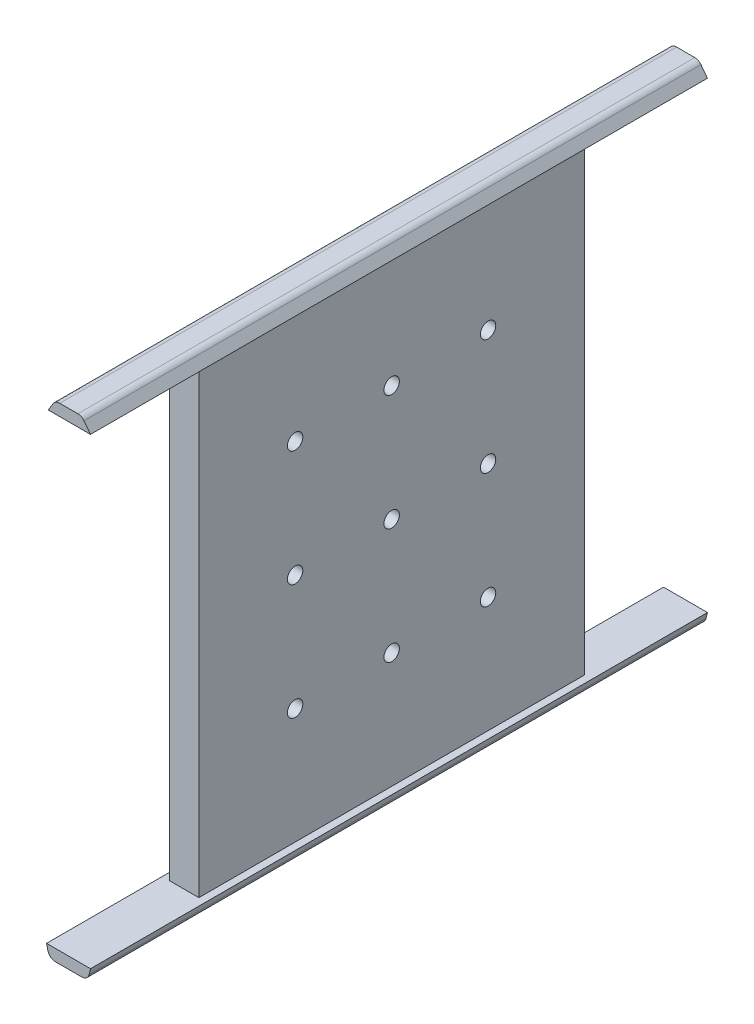
ISO-10303-21;
HEADER;
FILE_DESCRIPTION(('STEP AP214'),'2;1');
FILE_NAME('part.step','',(''),(''),'','','');
FILE_SCHEMA(('AUTOMOTIVE_DESIGN { 1 0 10303 214 1 1 1 1 }'));
ENDSEC;
DATA;
#1=APPLICATION_CONTEXT('core data for automotive mechanical design processes');
#2=APPLICATION_PROTOCOL_DEFINITION('international standard','automotive_design',2000,#1);
#3=PRODUCT_CONTEXT('',#1,'mechanical');
#4=PRODUCT('Part','Part','',(#3));
#5=PRODUCT_RELATED_PRODUCT_CATEGORY('part','',(#4));
#6=PRODUCT_DEFINITION_FORMATION('','',#4);
#7=PRODUCT_DEFINITION_CONTEXT('part definition',#1,'design');
#8=PRODUCT_DEFINITION('design','',#6,#7);
#9=PRODUCT_DEFINITION_SHAPE('','',#8);
#10=(LENGTH_UNIT() NAMED_UNIT(*) SI_UNIT(.MILLI.,.METRE.));
#11=(NAMED_UNIT(*) PLANE_ANGLE_UNIT() SI_UNIT($,.RADIAN.));
#12=(NAMED_UNIT(*) SI_UNIT($,.STERADIAN.) SOLID_ANGLE_UNIT());
#13=UNCERTAINTY_MEASURE_WITH_UNIT(LENGTH_MEASURE(1.E-05),#10,'distance_accuracy_value','');
#14=(GEOMETRIC_REPRESENTATION_CONTEXT(3) GLOBAL_UNCERTAINTY_ASSIGNED_CONTEXT((#13)) GLOBAL_UNIT_ASSIGNED_CONTEXT((#10,
#11,#12)) REPRESENTATION_CONTEXT('',''));
#15=CARTESIAN_POINT('',(0.,0.,0.));
#16=DIRECTION('',(0.,0.,1.));
#17=DIRECTION('',(1.,0.,0.));
#18=AXIS2_PLACEMENT_3D('',#15,#16,#17);
#19=CARTESIAN_POINT('',(-3.8,0.,160.));
#20=DIRECTION('',(-1.,0.,0.));
#21=DIRECTION('',(0.,-1.,0.));
#22=AXIS2_PLACEMENT_3D('',#19,#20,#21);
#23=PLANE('',#22);
#24=CARTESIAN_POINT('',(-3.79999999999999,-38.178624658982,105.042568922673));
#25=DIRECTION('',(-1.,0.,0.));
#26=DIRECTION('',(0.,-1.,0.));
#27=AXIS2_PLACEMENT_3D('',#24,#25,#26);
#28=CIRCLE('',#27,2.);
#29=CARTESIAN_POINT('',(-3.79999999999999,-40.178624658982,105.042568922673));
#30=VERTEX_POINT('',#29);
#31=EDGE_CURVE('E308',#30,#30,#28,.F.);
#32=ORIENTED_EDGE('',*,*,#31,.T.);
#33=EDGE_LOOP('',(#32));
#34=FACE_BOUND('',#33,.T.);
#35=CARTESIAN_POINT('',(-3.79999999999999,-8.17862465898205,55.));
#36=DIRECTION('',(-1.,0.,0.));
#37=DIRECTION('',(0.,-1.,0.));
#38=AXIS2_PLACEMENT_3D('',#35,#36,#37);
#39=CIRCLE('',#38,2.);
#40=CARTESIAN_POINT('',(-3.79999999999999,-10.178624658982,55.));
#41=VERTEX_POINT('',#40);
#42=EDGE_CURVE('E312',#41,#41,#39,.F.);
#43=ORIENTED_EDGE('',*,*,#42,.T.);
#44=EDGE_LOOP('',(#43));
#45=FACE_BOUND('',#44,.T.);
#46=CARTESIAN_POINT('',(-3.79999999999999,-68.178624658982,55.));
#47=DIRECTION('',(-1.,0.,0.));
#48=DIRECTION('',(0.,-1.,0.));
#49=AXIS2_PLACEMENT_3D('',#46,#47,#48);
#50=CIRCLE('',#49,2.);
#51=CARTESIAN_POINT('',(-3.79999999999999,-70.178624658982,55.));
#52=VERTEX_POINT('',#51);
#53=EDGE_CURVE('E316',#52,#52,#50,.F.);
#54=ORIENTED_EDGE('',*,*,#53,.T.);
#55=EDGE_LOOP('',(#54));
#56=FACE_BOUND('',#55,.T.);
#57=CARTESIAN_POINT('',(-3.79999999999999,-8.17862465898205,80.));
#58=DIRECTION('',(-1.,0.,0.));
#59=DIRECTION('',(0.,-1.,0.));
#60=AXIS2_PLACEMENT_3D('',#57,#58,#59);
#61=CIRCLE('',#60,2.);
#62=CARTESIAN_POINT('',(-3.79999999999999,-10.178624658982,80.));
#63=VERTEX_POINT('',#62);
#64=EDGE_CURVE('E320',#63,#63,#61,.F.);
#65=ORIENTED_EDGE('',*,*,#64,.T.);
#66=EDGE_LOOP('',(#65));
#67=FACE_BOUND('',#66,.T.);
#68=DIRECTION('',(0.,-1.,0.));
#69=VECTOR('',#68,1.);
#70=CARTESIAN_POINT('',(-3.8,21.821375341018,130.));
#71=LINE('',#70,#69);
#72=CARTESIAN_POINT('',(-3.8,21.821375341018,130.));
#73=VERTEX_POINT('',#72);
#74=CARTESIAN_POINT('',(-3.8,-98.178624658982,130.));
#75=VERTEX_POINT('',#74);
#76=EDGE_CURVE('E326',#73,#75,#71,.T.);
#77=ORIENTED_EDGE('',*,*,#76,.F.);
#78=DIRECTION('',(0.,0.,-1.));
#79=VECTOR('',#78,1.);
#80=CARTESIAN_POINT('',(-3.8,21.821375341018,160.));
#81=LINE('',#80,#79);
#82=CARTESIAN_POINT('',(-3.8,21.821375341018,30.));
#83=VERTEX_POINT('',#82);
#84=EDGE_CURVE('E12',#73,#83,#81,.T.);
#85=ORIENTED_EDGE('',*,*,#84,.T.);
#86=DIRECTION('',(0.,-1.,0.));
#87=VECTOR('',#86,1.);
#88=CARTESIAN_POINT('',(-3.8,21.821375341018,30.));
#89=LINE('',#88,#87);
#90=CARTESIAN_POINT('',(-3.8,-98.178624658982,30.));
#91=VERTEX_POINT('',#90);
#92=EDGE_CURVE('E392',#83,#91,#89,.T.);
#93=ORIENTED_EDGE('',*,*,#92,.T.);
#94=DIRECTION('',(0.,0.,-1.));
#95=VECTOR('',#94,1.);
#96=CARTESIAN_POINT('',(-3.79999999999998,-98.178624658982,160.));
#97=LINE('',#96,#95);
#98=EDGE_CURVE('E53',#75,#91,#97,.T.);
#99=ORIENTED_EDGE('',*,*,#98,.F.);
#100=EDGE_LOOP('',(#77,#85,#93,#99));
#101=FACE_BOUND('',#100,.T.);
#102=CARTESIAN_POINT('',(-3.79999999999999,-38.178624658982,80.));
#103=DIRECTION('',(-1.,0.,0.));
#104=DIRECTION('',(0.,-1.,0.));
#105=AXIS2_PLACEMENT_3D('',#102,#103,#104);
#106=CIRCLE('',#105,2.);
#107=CARTESIAN_POINT('',(-3.79999999999999,-40.178624658982,80.));
#108=VERTEX_POINT('',#107);
#109=EDGE_CURVE('E331',#108,#108,#106,.F.);
#110=ORIENTED_EDGE('',*,*,#109,.T.);
#111=EDGE_LOOP('',(#110));
#112=FACE_BOUND('',#111,.T.);
#113=CARTESIAN_POINT('',(-3.79999999999999,-68.178624658982,80.));
#114=DIRECTION('',(-1.,0.,0.));
#115=DIRECTION('',(0.,-1.,0.));
#116=AXIS2_PLACEMENT_3D('',#113,#114,#115);
#117=CIRCLE('',#116,2.);
#118=CARTESIAN_POINT('',(-3.79999999999999,-70.178624658982,80.));
#119=VERTEX_POINT('',#118);
#120=EDGE_CURVE('E335',#119,#119,#117,.F.);
#121=ORIENTED_EDGE('',*,*,#120,.T.);
#122=EDGE_LOOP('',(#121));
#123=FACE_BOUND('',#122,.T.);
#124=CARTESIAN_POINT('',(-3.79999999999999,-38.178624658982,55.));
#125=DIRECTION('',(-1.,0.,0.));
#126=DIRECTION('',(0.,-1.,0.));
#127=AXIS2_PLACEMENT_3D('',#124,#125,#126);
#128=CIRCLE('',#127,2.);
#129=CARTESIAN_POINT('',(-3.79999999999999,-40.178624658982,55.));
#130=VERTEX_POINT('',#129);
#131=EDGE_CURVE('E339',#130,#130,#128,.F.);
#132=ORIENTED_EDGE('',*,*,#131,.T.);
#133=EDGE_LOOP('',(#132));
#134=FACE_BOUND('',#133,.T.);
#135=CARTESIAN_POINT('',(-3.79999999999999,-68.178624658982,105.042568922673));
#136=DIRECTION('',(-1.,0.,0.));
#137=DIRECTION('',(0.,-1.,0.));
#138=AXIS2_PLACEMENT_3D('',#135,#136,#137);
#139=CIRCLE('',#138,2.);
#140=CARTESIAN_POINT('',(-3.79999999999999,-70.178624658982,105.042568922673));
#141=VERTEX_POINT('',#140);
#142=EDGE_CURVE('E343',#141,#141,#139,.F.);
#143=ORIENTED_EDGE('',*,*,#142,.T.);
#144=EDGE_LOOP('',(#143));
#145=FACE_BOUND('',#144,.T.);
#146=CARTESIAN_POINT('',(-3.79999999999999,-8.17862465898205,105.042568922673));
#147=DIRECTION('',(-1.,0.,0.));
#148=DIRECTION('',(0.,-1.,0.));
#149=AXIS2_PLACEMENT_3D('',#146,#147,#148);
#150=CIRCLE('',#149,2.);
#151=CARTESIAN_POINT('',(-3.79999999999999,-10.178624658982,105.042568922673));
#152=VERTEX_POINT('',#151);
#153=EDGE_CURVE('E346',#152,#152,#150,.F.);
#154=ORIENTED_EDGE('',*,*,#153,.T.);
#155=EDGE_LOOP('',(#154));
#156=FACE_BOUND('',#155,.T.);
#157=ADVANCED_FACE('F44',(#34,#45,#56,#67,#101,#112,#123,#134,#145,#156),#23,.T.);
#158=CARTESIAN_POINT('',(3.8,0.,160.));
#159=DIRECTION('',(-1.,0.,0.));
#160=DIRECTION('',(0.,-1.,0.));
#161=AXIS2_PLACEMENT_3D('',#158,#159,#160);
#162=PLANE('',#161);
#163=CARTESIAN_POINT('',(3.80000000000001,-38.178624658982,105.042568922673));
#164=DIRECTION('',(1.,0.,0.));
#165=DIRECTION('',(0.,0.,-1.));
#166=AXIS2_PLACEMENT_3D('',#163,#164,#165);
#167=CIRCLE('',#166,2.);
#168=CARTESIAN_POINT('',(3.80000000000001,-38.178624658982,103.042568922673));
#169=VERTEX_POINT('',#168);
#170=EDGE_CURVE('E348',#169,#169,#167,.T.);
#171=ORIENTED_EDGE('',*,*,#170,.F.);
#172=EDGE_LOOP('',(#171));
#173=FACE_BOUND('',#172,.T.);
#174=CARTESIAN_POINT('',(3.8,-8.17862465898205,55.));
#175=DIRECTION('',(1.,0.,0.));
#176=DIRECTION('',(0.,0.,-1.));
#177=AXIS2_PLACEMENT_3D('',#174,#175,#176);
#178=CIRCLE('',#177,2.);
#179=CARTESIAN_POINT('',(3.8,-8.17862465898205,53.));
#180=VERTEX_POINT('',#179);
#181=EDGE_CURVE('E361',#180,#180,#178,.T.);
#182=ORIENTED_EDGE('',*,*,#181,.F.);
#183=EDGE_LOOP('',(#182));
#184=FACE_BOUND('',#183,.T.);
#185=CARTESIAN_POINT('',(3.80000000000002,-68.178624658982,55.));
#186=DIRECTION('',(1.,0.,0.));
#187=DIRECTION('',(0.,0.,-1.));
#188=AXIS2_PLACEMENT_3D('',#185,#186,#187);
#189=CIRCLE('',#188,2.);
#190=CARTESIAN_POINT('',(3.80000000000002,-68.178624658982,53.));
#191=VERTEX_POINT('',#190);
#192=EDGE_CURVE('E369',#191,#191,#189,.T.);
#193=ORIENTED_EDGE('',*,*,#192,.F.);
#194=EDGE_LOOP('',(#193));
#195=FACE_BOUND('',#194,.T.);
#196=CARTESIAN_POINT('',(3.8,-8.17862465898205,80.));
#197=DIRECTION('',(1.,0.,0.));
#198=DIRECTION('',(0.,0.,-1.));
#199=AXIS2_PLACEMENT_3D('',#196,#197,#198);
#200=CIRCLE('',#199,2.);
#201=CARTESIAN_POINT('',(3.8,-8.17862465898205,78.));
#202=VERTEX_POINT('',#201);
#203=EDGE_CURVE('E377',#202,#202,#200,.T.);
#204=ORIENTED_EDGE('',*,*,#203,.F.);
#205=EDGE_LOOP('',(#204));
#206=FACE_BOUND('',#205,.T.);
#207=DIRECTION('',(0.,0.,-1.));
#208=VECTOR('',#207,1.);
#209=CARTESIAN_POINT('',(3.8,21.821375341018,160.));
#210=LINE('',#209,#208);
#211=CARTESIAN_POINT('',(3.80000000000002,21.821375341018,130.));
#212=VERTEX_POINT('',#211);
#213=CARTESIAN_POINT('',(3.80000000000002,21.821375341018,30.));
#214=VERTEX_POINT('',#213);
#215=EDGE_CURVE('E208',#212,#214,#210,.T.);
#216=ORIENTED_EDGE('',*,*,#215,.F.);
#217=DIRECTION('',(0.,1.,0.));
#218=VECTOR('',#217,1.);
#219=CARTESIAN_POINT('',(3.80000000000002,21.821375341018,130.));
#220=LINE('',#219,#218);
#221=CARTESIAN_POINT('',(3.80000000000002,-98.178624658982,130.));
#222=VERTEX_POINT('',#221);
#223=EDGE_CURVE('E388',#222,#212,#220,.T.);
#224=ORIENTED_EDGE('',*,*,#223,.F.);
#225=DIRECTION('',(0.,0.,-1.));
#226=VECTOR('',#225,1.);
#227=CARTESIAN_POINT('',(3.80000000000002,-98.178624658982,160.));
#228=LINE('',#227,#226);
#229=CARTESIAN_POINT('',(3.80000000000002,-98.178624658982,30.));
#230=VERTEX_POINT('',#229);
#231=EDGE_CURVE('E216',#222,#230,#228,.T.);
#232=ORIENTED_EDGE('',*,*,#231,.T.);
#233=DIRECTION('',(0.,1.,0.));
#234=VECTOR('',#233,1.);
#235=CARTESIAN_POINT('',(3.80000000000002,21.821375341018,30.));
#236=LINE('',#235,#234);
#237=EDGE_CURVE('E408',#230,#214,#236,.T.);
#238=ORIENTED_EDGE('',*,*,#237,.T.);
#239=EDGE_LOOP('',(#216,#224,#232,#238));
#240=FACE_BOUND('',#239,.T.);
#241=CARTESIAN_POINT('',(3.80000000000001,-38.178624658982,80.));
#242=DIRECTION('',(1.,0.,0.));
#243=DIRECTION('',(0.,0.,-1.));
#244=AXIS2_PLACEMENT_3D('',#241,#242,#243);
#245=CIRCLE('',#244,2.);
#246=CARTESIAN_POINT('',(3.80000000000001,-38.178624658982,78.));
#247=VERTEX_POINT('',#246);
#248=EDGE_CURVE('E381',#247,#247,#245,.T.);
#249=ORIENTED_EDGE('',*,*,#248,.F.);
#250=EDGE_LOOP('',(#249));
#251=FACE_BOUND('',#250,.T.);
#252=CARTESIAN_POINT('',(3.80000000000002,-68.178624658982,80.));
#253=DIRECTION('',(1.,0.,0.));
#254=DIRECTION('',(0.,0.,-1.));
#255=AXIS2_PLACEMENT_3D('',#252,#253,#254);
#256=CIRCLE('',#255,2.);
#257=CARTESIAN_POINT('',(3.80000000000002,-68.178624658982,78.));
#258=VERTEX_POINT('',#257);
#259=EDGE_CURVE('E373',#258,#258,#256,.T.);
#260=ORIENTED_EDGE('',*,*,#259,.F.);
#261=EDGE_LOOP('',(#260));
#262=FACE_BOUND('',#261,.T.);
#263=CARTESIAN_POINT('',(3.80000000000001,-38.178624658982,55.));
#264=DIRECTION('',(1.,0.,0.));
#265=DIRECTION('',(0.,0.,-1.));
#266=AXIS2_PLACEMENT_3D('',#263,#264,#265);
#267=CIRCLE('',#266,2.);
#268=CARTESIAN_POINT('',(3.80000000000001,-38.178624658982,53.));
#269=VERTEX_POINT('',#268);
#270=EDGE_CURVE('E365',#269,#269,#267,.T.);
#271=ORIENTED_EDGE('',*,*,#270,.F.);
#272=EDGE_LOOP('',(#271));
#273=FACE_BOUND('',#272,.T.);
#274=CARTESIAN_POINT('',(3.80000000000002,-68.178624658982,105.042568922673));
#275=DIRECTION('',(1.,0.,0.));
#276=DIRECTION('',(0.,0.,-1.));
#277=AXIS2_PLACEMENT_3D('',#274,#275,#276);
#278=CIRCLE('',#277,2.);
#279=CARTESIAN_POINT('',(3.80000000000002,-68.178624658982,103.042568922673));
#280=VERTEX_POINT('',#279);
#281=EDGE_CURVE('E357',#280,#280,#278,.T.);
#282=ORIENTED_EDGE('',*,*,#281,.F.);
#283=EDGE_LOOP('',(#282));
#284=FACE_BOUND('',#283,.T.);
#285=CARTESIAN_POINT('',(3.8,-8.17862465898205,105.042568922673));
#286=DIRECTION('',(1.,0.,0.));
#287=DIRECTION('',(0.,0.,-1.));
#288=AXIS2_PLACEMENT_3D('',#285,#286,#287);
#289=CIRCLE('',#288,2.);
#290=CARTESIAN_POINT('',(3.8,-8.17862465898205,103.042568922673));
#291=VERTEX_POINT('',#290);
#292=EDGE_CURVE('E349',#291,#291,#289,.T.);
#293=ORIENTED_EDGE('',*,*,#292,.F.);
#294=EDGE_LOOP('',(#293));
#295=FACE_BOUND('',#294,.T.);
#296=ADVANCED_FACE('F297',(#173,#184,#195,#206,#240,#251,#262,#273,#284,#295),#162,.F.);
#297=CARTESIAN_POINT('',(0.,0.,160.));
#298=DIRECTION('',(0.,0.,1.));
#299=DIRECTION('',(1.,0.,0.));
#300=AXIS2_PLACEMENT_3D('',#297,#298,#299);
#301=PLANE('',#300);
#302=DIRECTION('',(-1.,0.,0.));
#303=VECTOR('',#302,1.);
#304=CARTESIAN_POINT('',(0.,21.821375341018,160.));
#305=LINE('',#304,#303);
#306=CARTESIAN_POINT('',(5.70000000000001,21.821375341018,160.));
#307=VERTEX_POINT('',#306);
#308=CARTESIAN_POINT('',(-5.26679924331625,21.821375341018,160.));
#309=VERTEX_POINT('',#308);
#310=EDGE_CURVE('E200',#307,#309,#305,.T.);
#311=ORIENTED_EDGE('',*,*,#310,.F.);
#312=DIRECTION('',(-0.606268268229279,0.795260200775992,0.));
#313=VECTOR('',#312,1.);
#314=CARTESIAN_POINT('',(14.1258813531818,10.7688950319018,160.));
#315=LINE('',#314,#313);
#316=CARTESIAN_POINT('',(4.01326816928115,24.0339118774765,160.));
#317=VERTEX_POINT('',#316);
#318=EDGE_CURVE('E271',#307,#317,#315,.T.);
#319=ORIENTED_EDGE('',*,*,#318,.T.);
#320=CARTESIAN_POINT('',(2.42274776772917,22.8213753410179,160.));
#321=DIRECTION('',(0.,0.,1.));
#322=DIRECTION('',(1.,0.,0.));
#323=AXIS2_PLACEMENT_3D('',#320,#321,#322);
#324=CIRCLE('',#323,2.);
#325=CARTESIAN_POINT('',(2.42274776772917,24.821375341018,160.));
#326=VERTEX_POINT('',#325);
#327=EDGE_CURVE('E155',#326,#317,#324,.F.);
#328=ORIENTED_EDGE('',*,*,#327,.F.);
#329=DIRECTION('',(-1.,0.,0.));
#330=VECTOR('',#329,1.);
#331=CARTESIAN_POINT('',(0.,24.821375341018,160.));
#332=LINE('',#331,#330);
#333=CARTESIAN_POINT('',(-2.29779279131514,24.821375341018,160.));
#334=VERTEX_POINT('',#333);
#335=EDGE_CURVE('E149',#326,#334,#332,.T.);
#336=ORIENTED_EDGE('',*,*,#335,.T.);
#337=CARTESIAN_POINT('',(-2.29779279131514,22.8213753410179,160.));
#338=DIRECTION('',(0.,0.,1.));
#339=DIRECTION('',(1.,0.,0.));
#340=AXIS2_PLACEMENT_3D('',#337,#338,#339);
#341=CIRCLE('',#340,2.);
#342=CARTESIAN_POINT('',(-3.99915691907052,23.8727364135269,160.));
#343=VERTEX_POINT('',#342);
#344=EDGE_CURVE('E153',#334,#343,#341,.T.);
#345=ORIENTED_EDGE('',*,*,#344,.T.);
#346=DIRECTION('',(-0.52568053625448,-0.850682063877688,0.));
#347=VECTOR('',#346,1.);
#348=CARTESIAN_POINT('',(-13.5696072539082,8.38536360515385,160.));
#349=LINE('',#348,#347);
#350=EDGE_CURVE('E62',#343,#309,#349,.T.);
#351=ORIENTED_EDGE('',*,*,#350,.T.);
#352=EDGE_LOOP('',(#311,#319,#328,#336,#345,#351));
#353=FACE_BOUND('',#352,.T.);
#354=ADVANCED_FACE('F151',(#353),#301,.T.);
#355=DIRECTION('',(-0.227229615606411,-0.973841209741795,0.));
#356=VECTOR('',#355,1.);
#357=CARTESIAN_POINT('',(27.1312025062019,-6.33061391811356,160.));
#358=LINE('',#357,#356);
#359=CARTESIAN_POINT('',(5.70000000000001,-98.1786246589821,160.));
#360=VERTEX_POINT('',#359);
#361=CARTESIAN_POINT('',(5.3606261793837,-99.6330838901949,160.));
#362=VERTEX_POINT('',#361);
#363=EDGE_CURVE('E269',#360,#362,#358,.T.);
#364=ORIENTED_EDGE('',*,*,#363,.F.);
#365=DIRECTION('',(-1.,0.,0.));
#366=VECTOR('',#365,1.);
#367=CARTESIAN_POINT('',(0.,-98.178624658982,160.));
#368=LINE('',#367,#366);
#369=CARTESIAN_POINT('',(-5.69999999999999,-98.178624658982,160.));
#370=VERTEX_POINT('',#369);
#371=EDGE_CURVE('E121',#360,#370,#368,.T.);
#372=ORIENTED_EDGE('',*,*,#371,.T.);
#373=DIRECTION('',(-0.227229615606419,0.973841209741793,0.));
#374=VECTOR('',#373,1.);
#375=CARTESIAN_POINT('',(-27.1312025062026,-6.33061391811397,160.));
#376=LINE('',#375,#374);
#377=CARTESIAN_POINT('',(-5.36062617938366,-99.6330838901949,160.));
#378=VERTEX_POINT('',#377);
#379=EDGE_CURVE('E258',#378,#370,#376,.T.);
#380=ORIENTED_EDGE('',*,*,#379,.F.);
#381=CARTESIAN_POINT('',(-3.41294375990007,-99.178624658982,160.));
#382=DIRECTION('',(0.,0.,1.));
#383=DIRECTION('',(1.,0.,0.));
#384=AXIS2_PLACEMENT_3D('',#381,#382,#383);
#385=CIRCLE('',#384,2.);
#386=CARTESIAN_POINT('',(-3.41294375990007,-101.178624658982,160.));
#387=VERTEX_POINT('',#386);
#388=EDGE_CURVE('E259',#378,#387,#385,.T.);
#389=ORIENTED_EDGE('',*,*,#388,.T.);
#390=DIRECTION('',(1.,0.,0.));
#391=VECTOR('',#390,1.);
#392=CARTESIAN_POINT('',(0.,-101.178624658982,160.));
#393=LINE('',#392,#391);
#394=CARTESIAN_POINT('',(3.4129437599001,-101.178624658982,160.));
#395=VERTEX_POINT('',#394);
#396=EDGE_CURVE('E261',#387,#395,#393,.T.);
#397=ORIENTED_EDGE('',*,*,#396,.T.);
#398=CARTESIAN_POINT('',(3.4129437599001,-99.178624658982,160.));
#399=DIRECTION('',(0.,0.,1.));
#400=DIRECTION('',(1.,0.,0.));
#401=AXIS2_PLACEMENT_3D('',#398,#399,#400);
#402=CIRCLE('',#401,2.);
#403=EDGE_CURVE('E267',#395,#362,#402,.T.);
#404=ORIENTED_EDGE('',*,*,#403,.T.);
#405=EDGE_LOOP('',(#364,#372,#380,#389,#397,#404));
#406=FACE_BOUND('',#405,.T.);
#407=ADVANCED_FACE('F465',(#406),#301,.T.);
#408=CARTESIAN_POINT('',(0.,0.,0.));
#409=DIRECTION('',(0.,0.,1.));
#410=DIRECTION('',(1.,0.,0.));
#411=AXIS2_PLACEMENT_3D('',#408,#409,#410);
#412=PLANE('',#411);
#413=DIRECTION('',(-0.227229615606419,0.973841209741793,0.));
#414=VECTOR('',#413,1.);
#415=CARTESIAN_POINT('',(-27.1312025062026,-6.33061391811397,0.));
#416=LINE('',#415,#414);
#417=CARTESIAN_POINT('',(-5.36062617938366,-99.6330838901949,0.));
#418=VERTEX_POINT('',#417);
#419=CARTESIAN_POINT('',(-5.69999999999999,-98.178624658982,0.));
#420=VERTEX_POINT('',#419);
#421=EDGE_CURVE('E171',#418,#420,#416,.T.);
#422=ORIENTED_EDGE('',*,*,#421,.T.);
#423=DIRECTION('',(1.,0.,0.));
#424=VECTOR('',#423,1.);
#425=CARTESIAN_POINT('',(-7.17106379094956E-13,-98.178624658982,0.));
#426=LINE('',#425,#424);
#427=CARTESIAN_POINT('',(5.70000000000001,-98.1786246589821,0.));
#428=VERTEX_POINT('',#427);
#429=EDGE_CURVE('E185',#420,#428,#426,.T.);
#430=ORIENTED_EDGE('',*,*,#429,.T.);
#431=DIRECTION('',(-0.227229615606411,-0.973841209741795,0.));
#432=VECTOR('',#431,1.);
#433=CARTESIAN_POINT('',(27.1312025062019,-6.33061391811356,0.));
#434=LINE('',#433,#432);
#435=CARTESIAN_POINT('',(5.3606261793837,-99.6330838901949,0.));
#436=VERTEX_POINT('',#435);
#437=EDGE_CURVE('E182',#428,#436,#434,.T.);
#438=ORIENTED_EDGE('',*,*,#437,.T.);
#439=CARTESIAN_POINT('',(3.4129437599001,-99.178624658982,0.));
#440=DIRECTION('',(0.,0.,1.));
#441=DIRECTION('',(1.,0.,0.));
#442=AXIS2_PLACEMENT_3D('',#439,#440,#441);
#443=CIRCLE('',#442,2.);
#444=CARTESIAN_POINT('',(3.4129437599001,-101.178624658982,0.));
#445=VERTEX_POINT('',#444);
#446=EDGE_CURVE('E179',#445,#436,#443,.T.);
#447=ORIENTED_EDGE('',*,*,#446,.F.);
#448=DIRECTION('',(1.,0.,0.));
#449=VECTOR('',#448,1.);
#450=CARTESIAN_POINT('',(0.,-101.178624658982,0.));
#451=LINE('',#450,#449);
#452=CARTESIAN_POINT('',(-3.41294375990007,-101.178624658982,0.));
#453=VERTEX_POINT('',#452);
#454=EDGE_CURVE('E177',#453,#445,#451,.T.);
#455=ORIENTED_EDGE('',*,*,#454,.F.);
#456=CARTESIAN_POINT('',(-3.41294375990007,-99.178624658982,0.));
#457=DIRECTION('',(0.,0.,1.));
#458=DIRECTION('',(1.,0.,0.));
#459=AXIS2_PLACEMENT_3D('',#456,#457,#458);
#460=CIRCLE('',#459,2.);
#461=EDGE_CURVE('E174',#418,#453,#460,.T.);
#462=ORIENTED_EDGE('',*,*,#461,.F.);
#463=EDGE_LOOP('',(#422,#430,#438,#447,#455,#462));
#464=FACE_BOUND('',#463,.T.);
#465=ADVANCED_FACE('F250',(#464),#412,.F.);
#466=DIRECTION('',(-1.,0.,0.));
#467=VECTOR('',#466,1.);
#468=CARTESIAN_POINT('',(0.,21.821375341018,0.));
#469=LINE('',#468,#467);
#470=CARTESIAN_POINT('',(5.70000000000001,21.821375341018,0.));
#471=VERTEX_POINT('',#470);
#472=CARTESIAN_POINT('',(-5.26679924331625,21.821375341018,0.));
#473=VERTEX_POINT('',#472);
#474=EDGE_CURVE('E112',#471,#473,#469,.T.);
#475=ORIENTED_EDGE('',*,*,#474,.T.);
#476=DIRECTION('',(-0.52568053625448,-0.850682063877688,0.));
#477=VECTOR('',#476,1.);
#478=CARTESIAN_POINT('',(-13.5696072539082,8.38536360515385,0.));
#479=LINE('',#478,#477);
#480=CARTESIAN_POINT('',(-3.99915691907052,23.8727364135269,0.));
#481=VERTEX_POINT('',#480);
#482=EDGE_CURVE('E197',#481,#473,#479,.T.);
#483=ORIENTED_EDGE('',*,*,#482,.F.);
#484=CARTESIAN_POINT('',(-2.29779279131514,22.8213753410179,0.));
#485=DIRECTION('',(0.,0.,1.));
#486=DIRECTION('',(1.,0.,0.));
#487=AXIS2_PLACEMENT_3D('',#484,#485,#486);
#488=CIRCLE('',#487,2.);
#489=CARTESIAN_POINT('',(-2.29779279131514,24.821375341018,0.));
#490=VERTEX_POINT('',#489);
#491=EDGE_CURVE('E104',#490,#481,#488,.T.);
#492=ORIENTED_EDGE('',*,*,#491,.F.);
#493=DIRECTION('',(-1.,0.,0.));
#494=VECTOR('',#493,1.);
#495=CARTESIAN_POINT('',(0.,24.821375341018,0.));
#496=LINE('',#495,#494);
#497=CARTESIAN_POINT('',(2.42274776772917,24.821375341018,0.));
#498=VERTEX_POINT('',#497);
#499=EDGE_CURVE('E161',#498,#490,#496,.T.);
#500=ORIENTED_EDGE('',*,*,#499,.F.);
#501=CARTESIAN_POINT('',(2.42274776772917,22.8213753410179,0.));
#502=DIRECTION('',(0.,0.,1.));
#503=DIRECTION('',(1.,0.,0.));
#504=AXIS2_PLACEMENT_3D('',#501,#502,#503);
#505=CIRCLE('',#504,2.);
#506=CARTESIAN_POINT('',(4.01326816928115,24.0339118774765,0.));
#507=VERTEX_POINT('',#506);
#508=EDGE_CURVE('E192',#498,#507,#505,.F.);
#509=ORIENTED_EDGE('',*,*,#508,.T.);
#510=DIRECTION('',(-0.606268268229279,0.795260200775992,0.));
#511=VECTOR('',#510,1.);
#512=CARTESIAN_POINT('',(14.1258813531818,10.7688950319018,0.));
#513=LINE('',#512,#511);
#514=EDGE_CURVE('E189',#471,#507,#513,.T.);
#515=ORIENTED_EDGE('',*,*,#514,.F.);
#516=EDGE_LOOP('',(#475,#483,#492,#500,#509,#515));
#517=FACE_BOUND('',#516,.T.);
#518=ADVANCED_FACE('F276',(#517),#412,.F.);
#519=CARTESIAN_POINT('',(-27.1312025062026,-6.33061391811397,160.));
#520=DIRECTION('',(-0.973841209741793,-0.227229615606419,0.));
#521=DIRECTION('',(0.227229615606419,-0.973841209741793,0.));
#522=AXIS2_PLACEMENT_3D('',#519,#520,#521);
#523=PLANE('',#522);
#524=ORIENTED_EDGE('',*,*,#421,.F.);
#525=DIRECTION('',(0.,0.,-1.));
#526=VECTOR('',#525,1.);
#527=CARTESIAN_POINT('',(-5.36062617938366,-99.6330838901949,160.));
#528=LINE('',#527,#526);
#529=EDGE_CURVE('E231',#378,#418,#528,.T.);
#530=ORIENTED_EDGE('',*,*,#529,.F.);
#531=ORIENTED_EDGE('',*,*,#379,.T.);
#532=DIRECTION('',(0.,0.,-1.));
#533=VECTOR('',#532,1.);
#534=CARTESIAN_POINT('',(-5.69999999999999,-98.178624658982,160.));
#535=LINE('',#534,#533);
#536=EDGE_CURVE('E225',#370,#420,#535,.T.);
#537=ORIENTED_EDGE('',*,*,#536,.T.);
#538=EDGE_LOOP('',(#524,#530,#531,#537));
#539=FACE_BOUND('',#538,.T.);
#540=ADVANCED_FACE('F255',(#539),#523,.T.);
#541=CARTESIAN_POINT('',(-3.41294375990007,-99.178624658982,160.));
#542=DIRECTION('',(0.,0.,-1.));
#543=DIRECTION('',(-1.,0.,0.));
#544=AXIS2_PLACEMENT_3D('',#541,#542,#543);
#545=CYLINDRICAL_SURFACE('',#544,2.);
#546=ORIENTED_EDGE('',*,*,#461,.T.);
#547=DIRECTION('',(0.,0.,-1.));
#548=VECTOR('',#547,1.);
#549=CARTESIAN_POINT('',(-3.41294375990007,-101.178624658982,160.));
#550=LINE('',#549,#548);
#551=EDGE_CURVE('E233',#387,#453,#550,.T.);
#552=ORIENTED_EDGE('',*,*,#551,.F.);
#553=ORIENTED_EDGE('',*,*,#388,.F.);
#554=ORIENTED_EDGE('',*,*,#529,.T.);
#555=EDGE_LOOP('',(#546,#552,#553,#554));
#556=FACE_BOUND('',#555,.T.);
#557=ADVANCED_FACE('F453',(#556),#545,.T.);
#558=CARTESIAN_POINT('',(0.,-101.178624658982,160.));
#559=DIRECTION('',(0.,1.,0.));
#560=DIRECTION('',(0.,0.,1.));
#561=AXIS2_PLACEMENT_3D('',#558,#559,#560);
#562=PLANE('',#561);
#563=ORIENTED_EDGE('',*,*,#454,.T.);
#564=DIRECTION('',(0.,0.,-1.));
#565=VECTOR('',#564,1.);
#566=CARTESIAN_POINT('',(3.4129437599001,-101.178624658982,160.));
#567=LINE('',#566,#565);
#568=EDGE_CURVE('E236',#395,#445,#567,.T.);
#569=ORIENTED_EDGE('',*,*,#568,.F.);
#570=ORIENTED_EDGE('',*,*,#396,.F.);
#571=ORIENTED_EDGE('',*,*,#551,.T.);
#572=EDGE_LOOP('',(#563,#569,#570,#571));
#573=FACE_BOUND('',#572,.T.);
#574=ADVANCED_FACE('F449',(#573),#562,.F.);
#575=CARTESIAN_POINT('',(3.4129437599001,-99.178624658982,160.));
#576=DIRECTION('',(0.,0.,-1.));
#577=DIRECTION('',(-1.,0.,0.));
#578=AXIS2_PLACEMENT_3D('',#575,#576,#577);
#579=CYLINDRICAL_SURFACE('',#578,2.);
#580=ORIENTED_EDGE('',*,*,#446,.T.);
#581=DIRECTION('',(0.,0.,-1.));
#582=VECTOR('',#581,1.);
#583=CARTESIAN_POINT('',(5.3606261793837,-99.6330838901949,160.));
#584=LINE('',#583,#582);
#585=EDGE_CURVE('E239',#362,#436,#584,.T.);
#586=ORIENTED_EDGE('',*,*,#585,.F.);
#587=ORIENTED_EDGE('',*,*,#403,.F.);
#588=ORIENTED_EDGE('',*,*,#568,.T.);
#589=EDGE_LOOP('',(#580,#586,#587,#588));
#590=FACE_BOUND('',#589,.T.);
#591=ADVANCED_FACE('F444',(#590),#579,.T.);
#592=CARTESIAN_POINT('',(27.1312025062019,-6.33061391811356,160.));
#593=DIRECTION('',(0.973841209741795,-0.227229615606411,0.));
#594=DIRECTION('',(0.227229615606411,0.973841209741795,0.));
#595=AXIS2_PLACEMENT_3D('',#592,#593,#594);
#596=PLANE('',#595);
#597=ORIENTED_EDGE('',*,*,#437,.F.);
#598=DIRECTION('',(0.,0.,-1.));
#599=VECTOR('',#598,1.);
#600=CARTESIAN_POINT('',(5.70000000000001,-98.1786246589821,160.));
#601=LINE('',#600,#599);
#602=EDGE_CURVE('E222',#360,#428,#601,.T.);
#603=ORIENTED_EDGE('',*,*,#602,.F.);
#604=ORIENTED_EDGE('',*,*,#363,.T.);
#605=ORIENTED_EDGE('',*,*,#585,.T.);
#606=EDGE_LOOP('',(#597,#603,#604,#605));
#607=FACE_BOUND('',#606,.T.);
#608=ADVANCED_FACE('F246',(#607),#596,.T.);
#609=CARTESIAN_POINT('',(-7.17106379094956E-13,-98.178624658982,160.));
#610=DIRECTION('',(0.,1.,0.));
#611=DIRECTION('',(-1.,0.,0.));
#612=AXIS2_PLACEMENT_3D('',#609,#610,#611);
#613=PLANE('',#612);
#614=DIRECTION('',(1.,0.,0.));
#615=VECTOR('',#614,1.);
#616=CARTESIAN_POINT('',(-3.8,-98.178624658982,130.));
#617=LINE('',#616,#615);
#618=EDGE_CURVE('E393',#75,#222,#617,.T.);
#619=ORIENTED_EDGE('',*,*,#618,.F.);
#620=ORIENTED_EDGE('',*,*,#98,.T.);
#621=DIRECTION('',(1.,0.,0.));
#622=VECTOR('',#621,1.);
#623=CARTESIAN_POINT('',(-3.8,-98.178624658982,30.));
#624=LINE('',#623,#622);
#625=EDGE_CURVE('E406',#91,#230,#624,.T.);
#626=ORIENTED_EDGE('',*,*,#625,.T.);
#627=ORIENTED_EDGE('',*,*,#231,.F.);
#628=EDGE_LOOP('',(#619,#620,#626,#627));
#629=FACE_BOUND('',#628,.T.);
#630=ORIENTED_EDGE('',*,*,#429,.F.);
#631=ORIENTED_EDGE('',*,*,#536,.F.);
#632=ORIENTED_EDGE('',*,*,#371,.F.);
#633=ORIENTED_EDGE('',*,*,#602,.T.);
#634=EDGE_LOOP('',(#630,#631,#632,#633));
#635=FACE_BOUND('',#634,.T.);
#636=ADVANCED_FACE('F243',(#629,#635),#613,.T.);
#637=CARTESIAN_POINT('',(0.,21.821375341018,160.));
#638=DIRECTION('',(0.,-1.,0.));
#639=DIRECTION('',(0.,0.,-1.));
#640=AXIS2_PLACEMENT_3D('',#637,#638,#639);
#641=PLANE('',#640);
#642=DIRECTION('',(-1.,0.,0.));
#643=VECTOR('',#642,1.);
#644=CARTESIAN_POINT('',(-3.8,21.821375341018,130.));
#645=LINE('',#644,#643);
#646=EDGE_CURVE('E385',#212,#73,#645,.T.);
#647=ORIENTED_EDGE('',*,*,#646,.F.);
#648=ORIENTED_EDGE('',*,*,#215,.T.);
#649=DIRECTION('',(-1.,0.,0.));
#650=VECTOR('',#649,1.);
#651=CARTESIAN_POINT('',(-3.8,21.821375341018,30.));
#652=LINE('',#651,#650);
#653=EDGE_CURVE('E175',#214,#83,#652,.T.);
#654=ORIENTED_EDGE('',*,*,#653,.T.);
#655=ORIENTED_EDGE('',*,*,#84,.F.);
#656=EDGE_LOOP('',(#647,#648,#654,#655));
#657=FACE_BOUND('',#656,.T.);
#658=ORIENTED_EDGE('',*,*,#474,.F.);
#659=DIRECTION('',(0.,0.,-1.));
#660=VECTOR('',#659,1.);
#661=CARTESIAN_POINT('',(5.70000000000001,21.821375341018,160.));
#662=LINE('',#661,#660);
#663=EDGE_CURVE('E206',#307,#471,#662,.T.);
#664=ORIENTED_EDGE('',*,*,#663,.F.);
#665=ORIENTED_EDGE('',*,*,#310,.T.);
#666=DIRECTION('',(0.,0.,-1.));
#667=VECTOR('',#666,1.);
#668=CARTESIAN_POINT('',(-5.26679924331625,21.821375341018,160.));
#669=LINE('',#668,#667);
#670=EDGE_CURVE('E167',#309,#473,#669,.T.);
#671=ORIENTED_EDGE('',*,*,#670,.T.);
#672=EDGE_LOOP('',(#658,#664,#665,#671));
#673=FACE_BOUND('',#672,.T.);
#674=ADVANCED_FACE('F282',(#657,#673),#641,.T.);
#675=CARTESIAN_POINT('',(14.1258813531818,10.7688950319018,160.));
#676=DIRECTION('',(-0.795260200775992,-0.606268268229279,0.));
#677=DIRECTION('',(0.606268268229279,-0.795260200775992,0.));
#678=AXIS2_PLACEMENT_3D('',#675,#676,#677);
#679=PLANE('',#678);
#680=ORIENTED_EDGE('',*,*,#514,.T.);
#681=DIRECTION('',(0.,0.,-1.));
#682=VECTOR('',#681,1.);
#683=CARTESIAN_POINT('',(4.01326816928115,24.0339118774765,160.));
#684=LINE('',#683,#682);
#685=EDGE_CURVE('E204',#317,#507,#684,.T.);
#686=ORIENTED_EDGE('',*,*,#685,.F.);
#687=ORIENTED_EDGE('',*,*,#318,.F.);
#688=ORIENTED_EDGE('',*,*,#663,.T.);
#689=EDGE_LOOP('',(#680,#686,#687,#688));
#690=FACE_BOUND('',#689,.T.);
#691=ADVANCED_FACE('F286',(#690),#679,.F.);
#692=CARTESIAN_POINT('',(2.42274776772917,22.8213753410179,160.));
#693=DIRECTION('',(0.,0.,-1.));
#694=DIRECTION('',(-1.,0.,0.));
#695=AXIS2_PLACEMENT_3D('',#692,#693,#694);
#696=CYLINDRICAL_SURFACE('',#695,2.);
#697=ORIENTED_EDGE('',*,*,#508,.F.);
#698=DIRECTION('',(0.,0.,-1.));
#699=VECTOR('',#698,1.);
#700=CARTESIAN_POINT('',(2.42274776772917,24.821375341018,160.));
#701=LINE('',#700,#699);
#702=EDGE_CURVE('E162',#326,#498,#701,.T.);
#703=ORIENTED_EDGE('',*,*,#702,.F.);
#704=ORIENTED_EDGE('',*,*,#327,.T.);
#705=ORIENTED_EDGE('',*,*,#685,.T.);
#706=EDGE_LOOP('',(#697,#703,#704,#705));
#707=FACE_BOUND('',#706,.T.);
#708=ADVANCED_FACE('F274',(#707),#696,.T.);
#709=CARTESIAN_POINT('',(0.,24.821375341018,160.));
#710=DIRECTION('',(0.,-1.,0.));
#711=DIRECTION('',(1.,0.,0.));
#712=AXIS2_PLACEMENT_3D('',#709,#710,#711);
#713=PLANE('',#712);
#714=ORIENTED_EDGE('',*,*,#499,.T.);
#715=DIRECTION('',(0.,0.,-1.));
#716=VECTOR('',#715,1.);
#717=CARTESIAN_POINT('',(-2.29779279131514,24.821375341018,160.));
#718=LINE('',#717,#716);
#719=EDGE_CURVE('E158',#334,#490,#718,.T.);
#720=ORIENTED_EDGE('',*,*,#719,.F.);
#721=ORIENTED_EDGE('',*,*,#335,.F.);
#722=ORIENTED_EDGE('',*,*,#702,.T.);
#723=EDGE_LOOP('',(#714,#720,#721,#722));
#724=FACE_BOUND('',#723,.T.);
#725=ADVANCED_FACE('F159',(#724),#713,.F.);
#726=CARTESIAN_POINT('',(-2.29779279131514,22.8213753410179,160.));
#727=DIRECTION('',(0.,0.,-1.));
#728=DIRECTION('',(-1.,0.,0.));
#729=AXIS2_PLACEMENT_3D('',#726,#727,#728);
#730=CYLINDRICAL_SURFACE('',#729,2.);
#731=ORIENTED_EDGE('',*,*,#491,.T.);
#732=DIRECTION('',(0.,0.,-1.));
#733=VECTOR('',#732,1.);
#734=CARTESIAN_POINT('',(-3.99915691907052,23.8727364135269,160.));
#735=LINE('',#734,#733);
#736=EDGE_CURVE('E163',#343,#481,#735,.T.);
#737=ORIENTED_EDGE('',*,*,#736,.F.);
#738=ORIENTED_EDGE('',*,*,#344,.F.);
#739=ORIENTED_EDGE('',*,*,#719,.T.);
#740=EDGE_LOOP('',(#731,#737,#738,#739));
#741=FACE_BOUND('',#740,.T.);
#742=ADVANCED_FACE('F165',(#741),#730,.T.);
#743=CARTESIAN_POINT('',(-13.5696072539082,8.38536360515385,160.));
#744=DIRECTION('',(0.850682063877688,-0.52568053625448,0.));
#745=DIRECTION('',(0.52568053625448,0.850682063877688,0.));
#746=AXIS2_PLACEMENT_3D('',#743,#744,#745);
#747=PLANE('',#746);
#748=ORIENTED_EDGE('',*,*,#482,.T.);
#749=ORIENTED_EDGE('',*,*,#670,.F.);
#750=ORIENTED_EDGE('',*,*,#350,.F.);
#751=ORIENTED_EDGE('',*,*,#736,.T.);
#752=EDGE_LOOP('',(#748,#749,#750,#751));
#753=FACE_BOUND('',#752,.T.);
#754=ADVANCED_FACE('F278',(#753),#747,.F.);
#755=CARTESIAN_POINT('',(0.,0.,30.));
#756=DIRECTION('',(0.,0.,1.));
#757=DIRECTION('',(1.,0.,0.));
#758=AXIS2_PLACEMENT_3D('',#755,#756,#757);
#759=PLANE('',#758);
#760=ORIENTED_EDGE('',*,*,#92,.F.);
#761=ORIENTED_EDGE('',*,*,#653,.F.);
#762=ORIENTED_EDGE('',*,*,#237,.F.);
#763=ORIENTED_EDGE('',*,*,#625,.F.);
#764=EDGE_LOOP('',(#760,#761,#762,#763));
#765=FACE_BOUND('',#764,.T.);
#766=ADVANCED_FACE('F420',(#765),#759,.F.);
#767=CARTESIAN_POINT('',(0.,0.,130.));
#768=DIRECTION('',(0.,0.,-1.));
#769=DIRECTION('',(-1.,0.,0.));
#770=AXIS2_PLACEMENT_3D('',#767,#768,#769);
#771=PLANE('',#770);
#772=ORIENTED_EDGE('',*,*,#76,.T.);
#773=ORIENTED_EDGE('',*,*,#618,.T.);
#774=ORIENTED_EDGE('',*,*,#223,.T.);
#775=ORIENTED_EDGE('',*,*,#646,.T.);
#776=EDGE_LOOP('',(#772,#773,#774,#775));
#777=FACE_BOUND('',#776,.T.);
#778=ADVANCED_FACE('F436',(#777),#771,.F.);
#779=CARTESIAN_POINT('',(3.80000000000001,-38.178624658982,80.));
#780=DIRECTION('',(-1.,0.,0.));
#781=DIRECTION('',(0.,-1.,0.));
#782=AXIS2_PLACEMENT_3D('',#779,#780,#781);
#783=CYLINDRICAL_SURFACE('',#782,2.);
#784=ORIENTED_EDGE('',*,*,#109,.F.);
#785=EDGE_LOOP('',(#784));
#786=FACE_BOUND('',#785,.T.);
#787=ORIENTED_EDGE('',*,*,#248,.T.);
#788=EDGE_LOOP('',(#787));
#789=FACE_BOUND('',#788,.T.);
#790=ADVANCED_FACE('F498',(#786,#789),#783,.F.);
#791=CARTESIAN_POINT('',(3.8,-8.17862465898205,80.));
#792=DIRECTION('',(-1.,0.,0.));
#793=DIRECTION('',(0.,-1.,0.));
#794=AXIS2_PLACEMENT_3D('',#791,#792,#793);
#795=CYLINDRICAL_SURFACE('',#794,2.);
#796=ORIENTED_EDGE('',*,*,#64,.F.);
#797=EDGE_LOOP('',(#796));
#798=FACE_BOUND('',#797,.T.);
#799=ORIENTED_EDGE('',*,*,#203,.T.);
#800=EDGE_LOOP('',(#799));
#801=FACE_BOUND('',#800,.T.);
#802=ADVANCED_FACE('F516',(#798,#801),#795,.F.);
#803=CARTESIAN_POINT('',(3.80000000000002,-68.178624658982,80.));
#804=DIRECTION('',(-1.,0.,0.));
#805=DIRECTION('',(0.,-1.,0.));
#806=AXIS2_PLACEMENT_3D('',#803,#804,#805);
#807=CYLINDRICAL_SURFACE('',#806,2.);
#808=ORIENTED_EDGE('',*,*,#120,.F.);
#809=EDGE_LOOP('',(#808));
#810=FACE_BOUND('',#809,.T.);
#811=ORIENTED_EDGE('',*,*,#259,.T.);
#812=EDGE_LOOP('',(#811));
#813=FACE_BOUND('',#812,.T.);
#814=ADVANCED_FACE('F523',(#810,#813),#807,.F.);
#815=CARTESIAN_POINT('',(3.80000000000002,-68.178624658982,55.));
#816=DIRECTION('',(-1.,0.,0.));
#817=DIRECTION('',(0.,-1.,0.));
#818=AXIS2_PLACEMENT_3D('',#815,#816,#817);
#819=CYLINDRICAL_SURFACE('',#818,2.);
#820=ORIENTED_EDGE('',*,*,#53,.F.);
#821=EDGE_LOOP('',(#820));
#822=FACE_BOUND('',#821,.T.);
#823=ORIENTED_EDGE('',*,*,#192,.T.);
#824=EDGE_LOOP('',(#823));
#825=FACE_BOUND('',#824,.T.);
#826=ADVANCED_FACE('F531',(#822,#825),#819,.F.);
#827=CARTESIAN_POINT('',(3.80000000000001,-38.178624658982,55.));
#828=DIRECTION('',(-1.,0.,0.));
#829=DIRECTION('',(0.,-1.,0.));
#830=AXIS2_PLACEMENT_3D('',#827,#828,#829);
#831=CYLINDRICAL_SURFACE('',#830,2.);
#832=ORIENTED_EDGE('',*,*,#131,.F.);
#833=EDGE_LOOP('',(#832));
#834=FACE_BOUND('',#833,.T.);
#835=ORIENTED_EDGE('',*,*,#270,.T.);
#836=EDGE_LOOP('',(#835));
#837=FACE_BOUND('',#836,.T.);
#838=ADVANCED_FACE('F539',(#834,#837),#831,.F.);
#839=CARTESIAN_POINT('',(3.8,-8.17862465898205,55.));
#840=DIRECTION('',(-1.,0.,0.));
#841=DIRECTION('',(0.,-1.,0.));
#842=AXIS2_PLACEMENT_3D('',#839,#840,#841);
#843=CYLINDRICAL_SURFACE('',#842,2.);
#844=ORIENTED_EDGE('',*,*,#42,.F.);
#845=EDGE_LOOP('',(#844));
#846=FACE_BOUND('',#845,.T.);
#847=ORIENTED_EDGE('',*,*,#181,.T.);
#848=EDGE_LOOP('',(#847));
#849=FACE_BOUND('',#848,.T.);
#850=ADVANCED_FACE('F547',(#846,#849),#843,.F.);
#851=CARTESIAN_POINT('',(3.80000000000002,-68.178624658982,105.042568922673));
#852=DIRECTION('',(-1.,0.,0.));
#853=DIRECTION('',(0.,-1.,0.));
#854=AXIS2_PLACEMENT_3D('',#851,#852,#853);
#855=CYLINDRICAL_SURFACE('',#854,2.);
#856=ORIENTED_EDGE('',*,*,#142,.F.);
#857=EDGE_LOOP('',(#856));
#858=FACE_BOUND('',#857,.T.);
#859=ORIENTED_EDGE('',*,*,#281,.T.);
#860=EDGE_LOOP('',(#859));
#861=FACE_BOUND('',#860,.T.);
#862=ADVANCED_FACE('F555',(#858,#861),#855,.F.);
#863=CARTESIAN_POINT('',(3.80000000000001,-38.178624658982,105.042568922673));
#864=DIRECTION('',(-1.,0.,0.));
#865=DIRECTION('',(0.,-1.,0.));
#866=AXIS2_PLACEMENT_3D('',#863,#864,#865);
#867=CYLINDRICAL_SURFACE('',#866,2.);
#868=ORIENTED_EDGE('',*,*,#31,.F.);
#869=EDGE_LOOP('',(#868));
#870=FACE_BOUND('',#869,.T.);
#871=ORIENTED_EDGE('',*,*,#170,.T.);
#872=EDGE_LOOP('',(#871));
#873=FACE_BOUND('',#872,.T.);
#874=ADVANCED_FACE('F563',(#870,#873),#867,.F.);
#875=CARTESIAN_POINT('',(3.8,-8.17862465898205,105.042568922673));
#876=DIRECTION('',(-1.,0.,0.));
#877=DIRECTION('',(0.,-1.,0.));
#878=AXIS2_PLACEMENT_3D('',#875,#876,#877);
#879=CYLINDRICAL_SURFACE('',#878,2.);
#880=ORIENTED_EDGE('',*,*,#153,.F.);
#881=EDGE_LOOP('',(#880));
#882=FACE_BOUND('',#881,.T.);
#883=ORIENTED_EDGE('',*,*,#292,.T.);
#884=EDGE_LOOP('',(#883));
#885=FACE_BOUND('',#884,.T.);
#886=ADVANCED_FACE('F571',(#882,#885),#879,.F.);
#887=CLOSED_SHELL('',(#157,#296,#354,#407,#465,#518,#540,#557,#574,#591,#608,#636,#674,#691,
#708,#725,#742,#754,#766,#778,#790,#802,#814,#826,#838,#850,#862,#874,#886));
#888=MANIFOLD_SOLID_BREP('B2',#887);
#889=ADVANCED_BREP_SHAPE_REPRESENTATION('',(#18,#888),#14);
#890=SHAPE_DEFINITION_REPRESENTATION(#9,#889);
ENDSEC;
END-ISO-10303-21;
